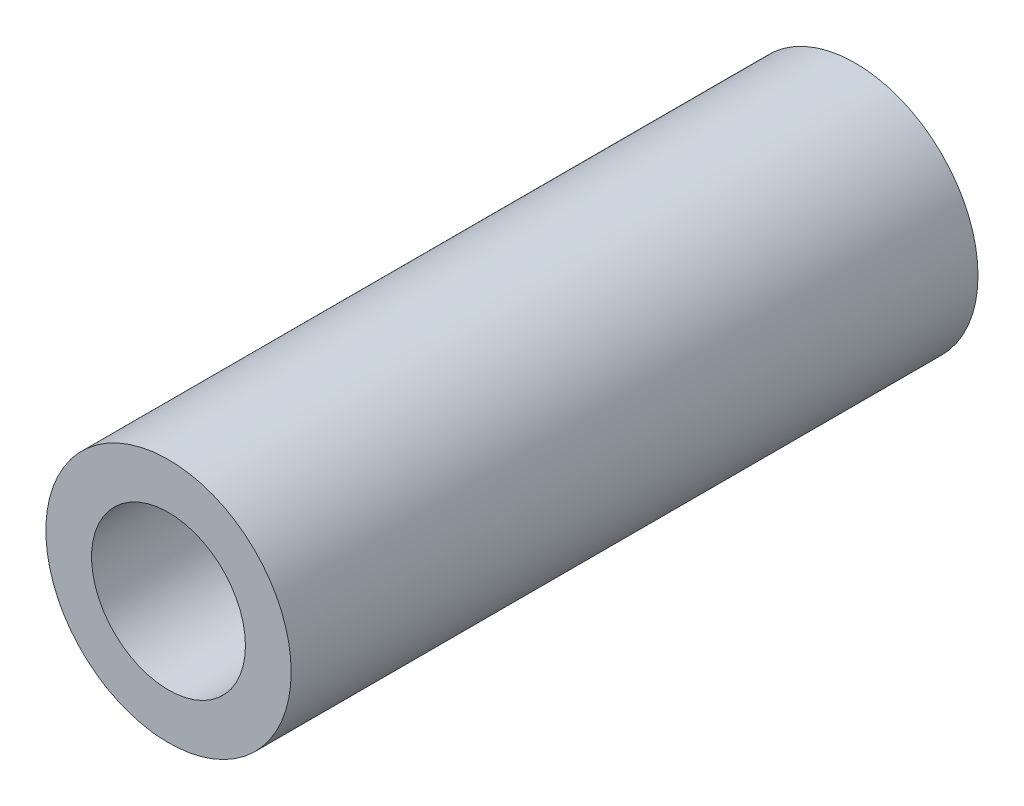
ISO-10303-21;
HEADER;
FILE_DESCRIPTION(('STEP AP214'),'2;1');
FILE_NAME('part.step','',(''),(''),'','','');
FILE_SCHEMA(('AUTOMOTIVE_DESIGN { 1 0 10303 214 1 1 1 1 }'));
ENDSEC;
DATA;
#1=APPLICATION_CONTEXT('core data for automotive mechanical design processes');
#2=APPLICATION_PROTOCOL_DEFINITION('international standard','automotive_design',2000,#1);
#3=PRODUCT_CONTEXT('',#1,'mechanical');
#4=PRODUCT('Part','Part','',(#3));
#5=PRODUCT_RELATED_PRODUCT_CATEGORY('part','',(#4));
#6=PRODUCT_DEFINITION_FORMATION('','',#4);
#7=PRODUCT_DEFINITION_CONTEXT('part definition',#1,'design');
#8=PRODUCT_DEFINITION('design','',#6,#7);
#9=PRODUCT_DEFINITION_SHAPE('','',#8);
#10=(LENGTH_UNIT() NAMED_UNIT(*) SI_UNIT(.MILLI.,.METRE.));
#11=(NAMED_UNIT(*) PLANE_ANGLE_UNIT() SI_UNIT($,.RADIAN.));
#12=(NAMED_UNIT(*) SI_UNIT($,.STERADIAN.) SOLID_ANGLE_UNIT());
#13=UNCERTAINTY_MEASURE_WITH_UNIT(LENGTH_MEASURE(1.E-05),#10,'distance_accuracy_value','');
#14=(GEOMETRIC_REPRESENTATION_CONTEXT(3) GLOBAL_UNCERTAINTY_ASSIGNED_CONTEXT((#13)) GLOBAL_UNIT_ASSIGNED_CONTEXT((#10,
#11,#12)) REPRESENTATION_CONTEXT('',''));
#15=CARTESIAN_POINT('',(0.,0.,0.));
#16=DIRECTION('',(0.,0.,1.));
#17=DIRECTION('',(1.,0.,0.));
#18=AXIS2_PLACEMENT_3D('',#15,#16,#17);
#19=CARTESIAN_POINT('',(0.,0.,22.225));
#20=DIRECTION('',(0.,0.,-1.));
#21=DIRECTION('',(-1.,0.,0.));
#22=AXIS2_PLACEMENT_3D('',#19,#20,#21);
#23=CYLINDRICAL_SURFACE('',#22,2.4892);
#24=CARTESIAN_POINT('',(0.,0.,22.225));
#25=DIRECTION('',(0.,0.,1.));
#26=DIRECTION('',(1.,0.,0.));
#27=AXIS2_PLACEMENT_3D('',#24,#25,#26);
#28=CIRCLE('',#27,2.4892);
#29=CARTESIAN_POINT('',(2.4892,0.,22.225));
#30=VERTEX_POINT('',#29);
#31=EDGE_CURVE('E45',#30,#30,#28,.T.);
#32=ORIENTED_EDGE('',*,*,#31,.T.);
#33=EDGE_LOOP('',(#32));
#34=FACE_BOUND('',#33,.T.);
#35=CARTESIAN_POINT('',(0.,0.,0.));
#36=DIRECTION('',(0.,0.,1.));
#37=DIRECTION('',(1.,0.,0.));
#38=AXIS2_PLACEMENT_3D('',#35,#36,#37);
#39=CIRCLE('',#38,2.4892);
#40=CARTESIAN_POINT('',(2.4892,0.,0.));
#41=VERTEX_POINT('',#40);
#42=EDGE_CURVE('E52',#41,#41,#39,.T.);
#43=ORIENTED_EDGE('',*,*,#42,.F.);
#44=EDGE_LOOP('',(#43));
#45=FACE_BOUND('',#44,.T.);
#46=ADVANCED_FACE('F37',(#34,#45),#23,.F.);
#47=CARTESIAN_POINT('',(0.,0.,22.225));
#48=DIRECTION('',(0.,0.,-1.));
#49=DIRECTION('',(-1.,0.,0.));
#50=AXIS2_PLACEMENT_3D('',#47,#48,#49);
#51=CYLINDRICAL_SURFACE('',#50,3.96875);
#52=CARTESIAN_POINT('',(0.,0.,22.225));
#53=DIRECTION('',(0.,0.,1.));
#54=DIRECTION('',(1.,0.,0.));
#55=AXIS2_PLACEMENT_3D('',#52,#53,#54);
#56=CIRCLE('',#55,3.96875);
#57=CARTESIAN_POINT('',(3.96875,0.,22.225));
#58=VERTEX_POINT('',#57);
#59=EDGE_CURVE('E10',#58,#58,#56,.T.);
#60=ORIENTED_EDGE('',*,*,#59,.F.);
#61=EDGE_LOOP('',(#60));
#62=FACE_BOUND('',#61,.T.);
#63=CARTESIAN_POINT('',(0.,0.,0.));
#64=DIRECTION('',(0.,0.,1.));
#65=DIRECTION('',(1.,0.,0.));
#66=AXIS2_PLACEMENT_3D('',#63,#64,#65);
#67=CIRCLE('',#66,3.96875);
#68=CARTESIAN_POINT('',(3.96875,0.,0.));
#69=VERTEX_POINT('',#68);
#70=EDGE_CURVE('E40',#69,#69,#67,.T.);
#71=ORIENTED_EDGE('',*,*,#70,.T.);
#72=EDGE_LOOP('',(#71));
#73=FACE_BOUND('',#72,.T.);
#74=ADVANCED_FACE('F61',(#62,#73),#51,.T.);
#75=CARTESIAN_POINT('',(0.,0.,22.225));
#76=DIRECTION('',(0.,0.,1.));
#77=DIRECTION('',(1.,0.,0.));
#78=AXIS2_PLACEMENT_3D('',#75,#76,#77);
#79=PLANE('',#78);
#80=ORIENTED_EDGE('',*,*,#31,.F.);
#81=EDGE_LOOP('',(#80));
#82=FACE_BOUND('',#81,.T.);
#83=ORIENTED_EDGE('',*,*,#59,.T.);
#84=EDGE_LOOP('',(#83));
#85=FACE_BOUND('',#84,.T.);
#86=ADVANCED_FACE('F65',(#82,#85),#79,.T.);
#87=CARTESIAN_POINT('',(0.,0.,0.));
#88=DIRECTION('',(0.,0.,1.));
#89=DIRECTION('',(1.,0.,0.));
#90=AXIS2_PLACEMENT_3D('',#87,#88,#89);
#91=PLANE('',#90);
#92=ORIENTED_EDGE('',*,*,#42,.T.);
#93=EDGE_LOOP('',(#92));
#94=FACE_BOUND('',#93,.T.);
#95=ORIENTED_EDGE('',*,*,#70,.F.);
#96=EDGE_LOOP('',(#95));
#97=FACE_BOUND('',#96,.T.);
#98=ADVANCED_FACE('F63',(#94,#97),#91,.F.);
#99=CLOSED_SHELL('',(#46,#74,#86,#98));
#100=MANIFOLD_SOLID_BREP('B2',#99);
#101=ADVANCED_BREP_SHAPE_REPRESENTATION('',(#18,#100),#14);
#102=SHAPE_DEFINITION_REPRESENTATION(#9,#101);
ENDSEC;
END-ISO-10303-21;
